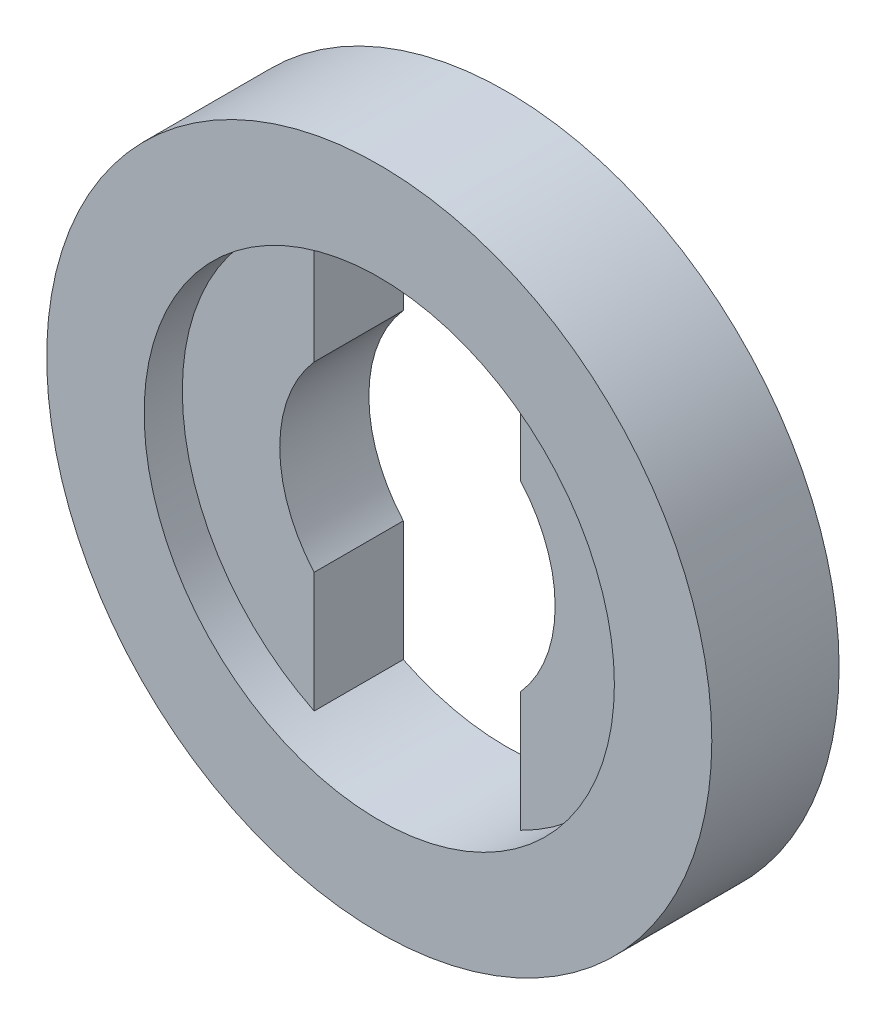
ISO-10303-21;
HEADER;
FILE_DESCRIPTION(('STEP AP214'),'2;1');
FILE_NAME('part.step','',(''),(''),'','','');
FILE_SCHEMA(('AUTOMOTIVE_DESIGN { 1 0 10303 214 1 1 1 1 }'));
ENDSEC;
DATA;
#1=APPLICATION_CONTEXT('core data for automotive mechanical design processes');
#2=APPLICATION_PROTOCOL_DEFINITION('international standard','automotive_design',2000,#1);
#3=PRODUCT_CONTEXT('',#1,'mechanical');
#4=PRODUCT('Part','Part','',(#3));
#5=PRODUCT_RELATED_PRODUCT_CATEGORY('part','',(#4));
#6=PRODUCT_DEFINITION_FORMATION('','',#4);
#7=PRODUCT_DEFINITION_CONTEXT('part definition',#1,'design');
#8=PRODUCT_DEFINITION('design','',#6,#7);
#9=PRODUCT_DEFINITION_SHAPE('','',#8);
#10=(LENGTH_UNIT() NAMED_UNIT(*) SI_UNIT(.MILLI.,.METRE.));
#11=(NAMED_UNIT(*) PLANE_ANGLE_UNIT() SI_UNIT($,.RADIAN.));
#12=(NAMED_UNIT(*) SI_UNIT($,.STERADIAN.) SOLID_ANGLE_UNIT());
#13=UNCERTAINTY_MEASURE_WITH_UNIT(LENGTH_MEASURE(1.E-05),#10,'distance_accuracy_value','');
#14=(GEOMETRIC_REPRESENTATION_CONTEXT(3) GLOBAL_UNCERTAINTY_ASSIGNED_CONTEXT((#13)) GLOBAL_UNIT_ASSIGNED_CONTEXT((#10,
#11,#12)) REPRESENTATION_CONTEXT('',''));
#15=CARTESIAN_POINT('',(0.,0.,0.));
#16=DIRECTION('',(0.,0.,1.));
#17=DIRECTION('',(1.,0.,0.));
#18=AXIS2_PLACEMENT_3D('',#15,#16,#17);
#19=CARTESIAN_POINT('',(0.,0.,0.6223));
#20=DIRECTION('',(0.,0.,-1.));
#21=DIRECTION('',(-1.,0.,0.));
#22=AXIS2_PLACEMENT_3D('',#19,#20,#21);
#23=CYLINDRICAL_SURFACE('',#22,1.3462);
#24=DIRECTION('',(0.,0.,1.));
#25=VECTOR('',#24,1.);
#26=CARTESIAN_POINT('',(-1.00965000000001,-0.890427603738781,-0.6223));
#27=LINE('',#26,#25);
#28=CARTESIAN_POINT('',(-1.00965000000001,-0.890427603738781,-0.6223));
#29=VERTEX_POINT('',#28);
#30=CARTESIAN_POINT('',(-1.00965000000001,-0.890427603738781,0.24892));
#31=VERTEX_POINT('',#30);
#32=EDGE_CURVE('E148',#29,#31,#27,.T.);
#33=ORIENTED_EDGE('',*,*,#32,.F.);
#34=CARTESIAN_POINT('',(0.,0.,-0.6223));
#35=DIRECTION('',(0.,0.,1.));
#36=DIRECTION('',(1.,0.,0.));
#37=AXIS2_PLACEMENT_3D('',#34,#35,#36);
#38=CIRCLE('',#37,1.3462);
#39=CARTESIAN_POINT('',(-1.00965,0.890427603738788,-0.6223));
#40=VERTEX_POINT('',#39);
#41=EDGE_CURVE('E180',#40,#29,#38,.T.);
#42=ORIENTED_EDGE('',*,*,#41,.F.);
#43=DIRECTION('',(0.,0.,1.));
#44=VECTOR('',#43,1.);
#45=CARTESIAN_POINT('',(-1.00965,0.890427603738788,-0.6223));
#46=LINE('',#45,#44);
#47=CARTESIAN_POINT('',(-1.00965,0.890427603738788,0.24892));
#48=VERTEX_POINT('',#47);
#49=EDGE_CURVE('E170',#40,#48,#46,.T.);
#50=ORIENTED_EDGE('',*,*,#49,.T.);
#51=CARTESIAN_POINT('',(0.,0.,0.24892));
#52=DIRECTION('',(0.,0.,1.));
#53=DIRECTION('',(1.,0.,0.));
#54=AXIS2_PLACEMENT_3D('',#51,#52,#53);
#55=CIRCLE('',#54,1.3462);
#56=EDGE_CURVE('E54',#48,#31,#55,.T.);
#57=ORIENTED_EDGE('',*,*,#56,.T.);
#58=EDGE_LOOP('',(#33,#42,#50,#57));
#59=FACE_BOUND('',#58,.T.);
#60=ADVANCED_FACE('F50',(#59),#23,.F.);
#61=CARTESIAN_POINT('',(0.,0.,0.24892));
#62=DIRECTION('',(0.,0.,1.));
#63=DIRECTION('',(1.,0.,0.));
#64=AXIS2_PLACEMENT_3D('',#61,#62,#63);
#65=PLANE('',#64);
#66=DIRECTION('',(0.,-1.,0.));
#67=VECTOR('',#66,1.);
#68=CARTESIAN_POINT('',(-1.00965000000001,-2.06509771378983,0.24892));
#69=LINE('',#68,#67);
#70=CARTESIAN_POINT('',(-1.00965000000001,-2.06509771378983,0.24892));
#71=VERTEX_POINT('',#70);
#72=EDGE_CURVE('E137',#31,#71,#69,.T.);
#73=ORIENTED_EDGE('',*,*,#72,.F.);
#74=ORIENTED_EDGE('',*,*,#56,.F.);
#75=DIRECTION('',(0.,-1.,0.));
#76=VECTOR('',#75,1.);
#77=CARTESIAN_POINT('',(-1.00965,2.06509771378983,0.24892));
#78=LINE('',#77,#76);
#79=CARTESIAN_POINT('',(-1.00965,2.06509771378983,0.24892));
#80=VERTEX_POINT('',#79);
#81=EDGE_CURVE('E147',#80,#48,#78,.T.);
#82=ORIENTED_EDGE('',*,*,#81,.F.);
#83=CARTESIAN_POINT('',(0.,0.,0.24892));
#84=DIRECTION('',(0.,0.,1.));
#85=DIRECTION('',(1.,0.,0.));
#86=AXIS2_PLACEMENT_3D('',#83,#84,#85);
#87=CIRCLE('',#86,2.2987);
#88=EDGE_CURVE('E174',#80,#71,#87,.T.);
#89=ORIENTED_EDGE('',*,*,#88,.T.);
#90=EDGE_LOOP('',(#73,#74,#82,#89));
#91=FACE_BOUND('',#90,.T.);
#92=ADVANCED_FACE('F197',(#91),#65,.T.);
#93=DIRECTION('',(0.,0.,1.));
#94=VECTOR('',#93,1.);
#95=CARTESIAN_POINT('',(1.00964999999999,-0.890427603738795,-0.6223));
#96=LINE('',#95,#94);
#97=CARTESIAN_POINT('',(1.00964999999999,-0.890427603738795,-0.6223));
#98=VERTEX_POINT('',#97);
#99=CARTESIAN_POINT('',(1.00964999999999,-0.890427603738795,0.24892));
#100=VERTEX_POINT('',#99);
#101=EDGE_CURVE('E125',#98,#100,#96,.T.);
#102=ORIENTED_EDGE('',*,*,#101,.T.);
#103=CARTESIAN_POINT('',(1.00965,0.890427603738788,0.24892));
#104=VERTEX_POINT('',#103);
#105=EDGE_CURVE('E177',#100,#104,#55,.T.);
#106=ORIENTED_EDGE('',*,*,#105,.T.);
#107=DIRECTION('',(0.,0.,1.));
#108=VECTOR('',#107,1.);
#109=CARTESIAN_POINT('',(1.00965,0.890427603738788,-0.6223));
#110=LINE('',#109,#108);
#111=CARTESIAN_POINT('',(1.00965,0.890427603738788,-0.6223));
#112=VERTEX_POINT('',#111);
#113=EDGE_CURVE('E167',#112,#104,#110,.T.);
#114=ORIENTED_EDGE('',*,*,#113,.F.);
#115=EDGE_CURVE('E181',#98,#112,#38,.T.);
#116=ORIENTED_EDGE('',*,*,#115,.F.);
#117=EDGE_LOOP('',(#102,#106,#114,#116));
#118=FACE_BOUND('',#117,.T.);
#119=ADVANCED_FACE('F193',(#118),#23,.F.);
#120=CARTESIAN_POINT('',(0.,0.,0.6223));
#121=DIRECTION('',(0.,0.,1.));
#122=DIRECTION('',(1.,0.,0.));
#123=AXIS2_PLACEMENT_3D('',#120,#121,#122);
#124=PLANE('',#123);
#125=CARTESIAN_POINT('',(0.,0.,0.6223));
#126=DIRECTION('',(0.,0.,1.));
#127=DIRECTION('',(1.,0.,0.));
#128=AXIS2_PLACEMENT_3D('',#125,#126,#127);
#129=CIRCLE('',#128,2.2987);
#130=CARTESIAN_POINT('',(2.2987,0.,0.6223));
#131=VERTEX_POINT('',#130);
#132=EDGE_CURVE('E166',#131,#131,#129,.T.);
#133=ORIENTED_EDGE('',*,*,#132,.F.);
#134=EDGE_LOOP('',(#133));
#135=FACE_BOUND('',#134,.T.);
#136=CARTESIAN_POINT('',(0.,0.,0.6223));
#137=DIRECTION('',(0.,0.,1.));
#138=DIRECTION('',(1.,0.,0.));
#139=AXIS2_PLACEMENT_3D('',#136,#137,#138);
#140=CIRCLE('',#139,3.2512);
#141=CARTESIAN_POINT('',(3.2512,0.,0.6223));
#142=VERTEX_POINT('',#141);
#143=EDGE_CURVE('E13',#142,#142,#140,.T.);
#144=ORIENTED_EDGE('',*,*,#143,.T.);
#145=EDGE_LOOP('',(#144));
#146=FACE_BOUND('',#145,.T.);
#147=ADVANCED_FACE('F187',(#135,#146),#124,.T.);
#148=CARTESIAN_POINT('',(0.,0.,-0.6223));
#149=DIRECTION('',(0.,0.,1.));
#150=DIRECTION('',(1.,0.,0.));
#151=AXIS2_PLACEMENT_3D('',#148,#149,#150);
#152=PLANE('',#151);
#153=CARTESIAN_POINT('',(0.,0.,-0.6223));
#154=DIRECTION('',(0.,0.,1.));
#155=DIRECTION('',(1.,0.,0.));
#156=AXIS2_PLACEMENT_3D('',#153,#154,#155);
#157=CIRCLE('',#156,3.2512);
#158=CARTESIAN_POINT('',(3.2512,0.,-0.6223));
#159=VERTEX_POINT('',#158);
#160=EDGE_CURVE('E59',#159,#159,#157,.T.);
#161=ORIENTED_EDGE('',*,*,#160,.F.);
#162=EDGE_LOOP('',(#161));
#163=FACE_BOUND('',#162,.T.);
#164=ORIENTED_EDGE('',*,*,#41,.T.);
#165=DIRECTION('',(0.,-1.,0.));
#166=VECTOR('',#165,1.);
#167=CARTESIAN_POINT('',(-1.00965000000001,-2.06509771378983,-0.6223));
#168=LINE('',#167,#166);
#169=CARTESIAN_POINT('',(-1.00965000000001,-2.06509771378983,-0.6223));
#170=VERTEX_POINT('',#169);
#171=EDGE_CURVE('E126',#29,#170,#168,.T.);
#172=ORIENTED_EDGE('',*,*,#171,.T.);
#173=CARTESIAN_POINT('',(0.,0.,-0.6223));
#174=DIRECTION('',(0.,0.,1.));
#175=DIRECTION('',(-1.,0.,0.));
#176=AXIS2_PLACEMENT_3D('',#173,#174,#175);
#177=CIRCLE('',#176,2.2987);
#178=CARTESIAN_POINT('',(1.00964999999999,-2.06509771378984,-0.6223));
#179=VERTEX_POINT('',#178);
#180=EDGE_CURVE('E121',#170,#179,#177,.T.);
#181=ORIENTED_EDGE('',*,*,#180,.T.);
#182=DIRECTION('',(0.,1.,0.));
#183=VECTOR('',#182,1.);
#184=CARTESIAN_POINT('',(1.00964999999999,-2.06509771378984,-0.6223));
#185=LINE('',#184,#183);
#186=EDGE_CURVE('E129',#179,#98,#185,.T.);
#187=ORIENTED_EDGE('',*,*,#186,.T.);
#188=ORIENTED_EDGE('',*,*,#115,.T.);
#189=DIRECTION('',(0.,1.,0.));
#190=VECTOR('',#189,1.);
#191=CARTESIAN_POINT('',(1.00965,2.06509771378983,-0.6223));
#192=LINE('',#191,#190);
#193=CARTESIAN_POINT('',(1.00965,2.06509771378983,-0.6223));
#194=VERTEX_POINT('',#193);
#195=EDGE_CURVE('E158',#112,#194,#192,.T.);
#196=ORIENTED_EDGE('',*,*,#195,.T.);
#197=CARTESIAN_POINT('',(0.,0.,-0.6223));
#198=DIRECTION('',(0.,0.,1.));
#199=DIRECTION('',(1.,0.,0.));
#200=AXIS2_PLACEMENT_3D('',#197,#198,#199);
#201=CIRCLE('',#200,2.2987);
#202=CARTESIAN_POINT('',(-1.00965,2.06509771378983,-0.6223));
#203=VERTEX_POINT('',#202);
#204=EDGE_CURVE('E151',#194,#203,#201,.T.);
#205=ORIENTED_EDGE('',*,*,#204,.T.);
#206=DIRECTION('',(0.,-1.,0.));
#207=VECTOR('',#206,1.);
#208=CARTESIAN_POINT('',(-1.00965,2.06509771378983,-0.6223));
#209=LINE('',#208,#207);
#210=EDGE_CURVE('E154',#203,#40,#209,.T.);
#211=ORIENTED_EDGE('',*,*,#210,.T.);
#212=EDGE_LOOP('',(#164,#172,#181,#187,#188,#196,#205,#211));
#213=FACE_BOUND('',#212,.T.);
#214=ADVANCED_FACE('F136',(#163,#213),#152,.F.);
#215=CARTESIAN_POINT('',(0.,0.,0.6223));
#216=DIRECTION('',(0.,0.,-1.));
#217=DIRECTION('',(-1.,0.,0.));
#218=AXIS2_PLACEMENT_3D('',#215,#216,#217);
#219=CYLINDRICAL_SURFACE('',#218,3.2512);
#220=ORIENTED_EDGE('',*,*,#143,.F.);
#221=EDGE_LOOP('',(#220));
#222=FACE_BOUND('',#221,.T.);
#223=ORIENTED_EDGE('',*,*,#160,.T.);
#224=EDGE_LOOP('',(#223));
#225=FACE_BOUND('',#224,.T.);
#226=ADVANCED_FACE('F52',(#222,#225),#219,.T.);
#227=CARTESIAN_POINT('',(0.,0.,0.24892));
#228=DIRECTION('',(0.,0.,1.));
#229=DIRECTION('',(1.,0.,0.));
#230=AXIS2_PLACEMENT_3D('',#227,#228,#229);
#231=CYLINDRICAL_SURFACE('',#230,2.2987);
#232=ORIENTED_EDGE('',*,*,#88,.F.);
#233=DIRECTION('',(0.,0.,1.));
#234=VECTOR('',#233,1.);
#235=CARTESIAN_POINT('',(-1.00965,2.06509771378983,-0.6223));
#236=LINE('',#235,#234);
#237=EDGE_CURVE('E75',#203,#80,#236,.T.);
#238=ORIENTED_EDGE('',*,*,#237,.F.);
#239=ORIENTED_EDGE('',*,*,#204,.F.);
#240=DIRECTION('',(0.,0.,1.));
#241=VECTOR('',#240,1.);
#242=CARTESIAN_POINT('',(1.00965,2.06509771378983,-0.6223));
#243=LINE('',#242,#241);
#244=CARTESIAN_POINT('',(1.00965,2.06509771378983,0.24892));
#245=VERTEX_POINT('',#244);
#246=EDGE_CURVE('E164',#194,#245,#243,.T.);
#247=ORIENTED_EDGE('',*,*,#246,.T.);
#248=CARTESIAN_POINT('',(1.00964999999999,-2.06509771378984,0.24892));
#249=VERTEX_POINT('',#248);
#250=EDGE_CURVE('E124',#249,#245,#87,.T.);
#251=ORIENTED_EDGE('',*,*,#250,.F.);
#252=DIRECTION('',(0.,0.,1.));
#253=VECTOR('',#252,1.);
#254=CARTESIAN_POINT('',(1.00964999999999,-2.06509771378984,-0.6223));
#255=LINE('',#254,#253);
#256=EDGE_CURVE('E67',#179,#249,#255,.T.);
#257=ORIENTED_EDGE('',*,*,#256,.F.);
#258=ORIENTED_EDGE('',*,*,#180,.F.);
#259=DIRECTION('',(0.,0.,1.));
#260=VECTOR('',#259,1.);
#261=CARTESIAN_POINT('',(-1.00965000000001,-2.06509771378983,-0.6223));
#262=LINE('',#261,#260);
#263=EDGE_CURVE('E145',#170,#71,#262,.T.);
#264=ORIENTED_EDGE('',*,*,#263,.T.);
#265=EDGE_LOOP('',(#232,#238,#239,#247,#251,#257,#258,#264));
#266=FACE_BOUND('',#265,.T.);
#267=ORIENTED_EDGE('',*,*,#132,.T.);
#268=EDGE_LOOP('',(#267));
#269=FACE_BOUND('',#268,.T.);
#270=ADVANCED_FACE('F118',(#266,#269),#231,.F.);
#271=DIRECTION('',(0.,1.,0.));
#272=VECTOR('',#271,1.);
#273=CARTESIAN_POINT('',(1.00964999999999,-2.06509771378984,0.24892));
#274=LINE('',#273,#272);
#275=EDGE_CURVE('E140',#249,#100,#274,.T.);
#276=ORIENTED_EDGE('',*,*,#275,.F.);
#277=ORIENTED_EDGE('',*,*,#250,.T.);
#278=DIRECTION('',(0.,1.,0.));
#279=VECTOR('',#278,1.);
#280=CARTESIAN_POINT('',(1.00965,2.06509771378983,0.24892));
#281=LINE('',#280,#279);
#282=EDGE_CURVE('E155',#104,#245,#281,.T.);
#283=ORIENTED_EDGE('',*,*,#282,.F.);
#284=ORIENTED_EDGE('',*,*,#105,.F.);
#285=EDGE_LOOP('',(#276,#277,#283,#284));
#286=FACE_BOUND('',#285,.T.);
#287=ADVANCED_FACE('F205',(#286),#65,.T.);
#288=CARTESIAN_POINT('',(1.00965,2.06509771378983,-0.6223));
#289=DIRECTION('',(1.,0.,0.));
#290=DIRECTION('',(0.,1.,0.));
#291=AXIS2_PLACEMENT_3D('',#288,#289,#290);
#292=PLANE('',#291);
#293=ORIENTED_EDGE('',*,*,#282,.T.);
#294=ORIENTED_EDGE('',*,*,#246,.F.);
#295=ORIENTED_EDGE('',*,*,#195,.F.);
#296=ORIENTED_EDGE('',*,*,#113,.T.);
#297=EDGE_LOOP('',(#293,#294,#295,#296));
#298=FACE_BOUND('',#297,.T.);
#299=ADVANCED_FACE('F220',(#298),#292,.F.);
#300=CARTESIAN_POINT('',(-1.00965,2.06509771378983,-0.6223));
#301=DIRECTION('',(-1.,0.,0.));
#302=DIRECTION('',(0.,-1.,0.));
#303=AXIS2_PLACEMENT_3D('',#300,#301,#302);
#304=PLANE('',#303);
#305=ORIENTED_EDGE('',*,*,#81,.T.);
#306=ORIENTED_EDGE('',*,*,#49,.F.);
#307=ORIENTED_EDGE('',*,*,#210,.F.);
#308=ORIENTED_EDGE('',*,*,#237,.T.);
#309=EDGE_LOOP('',(#305,#306,#307,#308));
#310=FACE_BOUND('',#309,.T.);
#311=ADVANCED_FACE('F226',(#310),#304,.F.);
#312=CARTESIAN_POINT('',(-1.00965000000001,-2.06509771378983,-0.6223));
#313=DIRECTION('',(-1.,0.,0.));
#314=DIRECTION('',(0.,-1.,0.));
#315=AXIS2_PLACEMENT_3D('',#312,#313,#314);
#316=PLANE('',#315);
#317=ORIENTED_EDGE('',*,*,#72,.T.);
#318=ORIENTED_EDGE('',*,*,#263,.F.);
#319=ORIENTED_EDGE('',*,*,#171,.F.);
#320=ORIENTED_EDGE('',*,*,#32,.T.);
#321=EDGE_LOOP('',(#317,#318,#319,#320));
#322=FACE_BOUND('',#321,.T.);
#323=ADVANCED_FACE('F225',(#322),#316,.F.);
#324=CARTESIAN_POINT('',(1.00964999999999,-2.06509771378984,-0.6223));
#325=DIRECTION('',(1.,0.,0.));
#326=DIRECTION('',(0.,1.,0.));
#327=AXIS2_PLACEMENT_3D('',#324,#325,#326);
#328=PLANE('',#327);
#329=ORIENTED_EDGE('',*,*,#275,.T.);
#330=ORIENTED_EDGE('',*,*,#101,.F.);
#331=ORIENTED_EDGE('',*,*,#186,.F.);
#332=ORIENTED_EDGE('',*,*,#256,.T.);
#333=EDGE_LOOP('',(#329,#330,#331,#332));
#334=FACE_BOUND('',#333,.T.);
#335=ADVANCED_FACE('F130',(#334),#328,.F.);
#336=CLOSED_SHELL('',(#60,#92,#119,#147,#214,#226,#270,#287,#299,#311,#323,#335));
#337=MANIFOLD_SOLID_BREP('B2',#336);
#338=ADVANCED_BREP_SHAPE_REPRESENTATION('',(#18,#337),#14);
#339=SHAPE_DEFINITION_REPRESENTATION(#9,#338);
ENDSEC;
END-ISO-10303-21;
